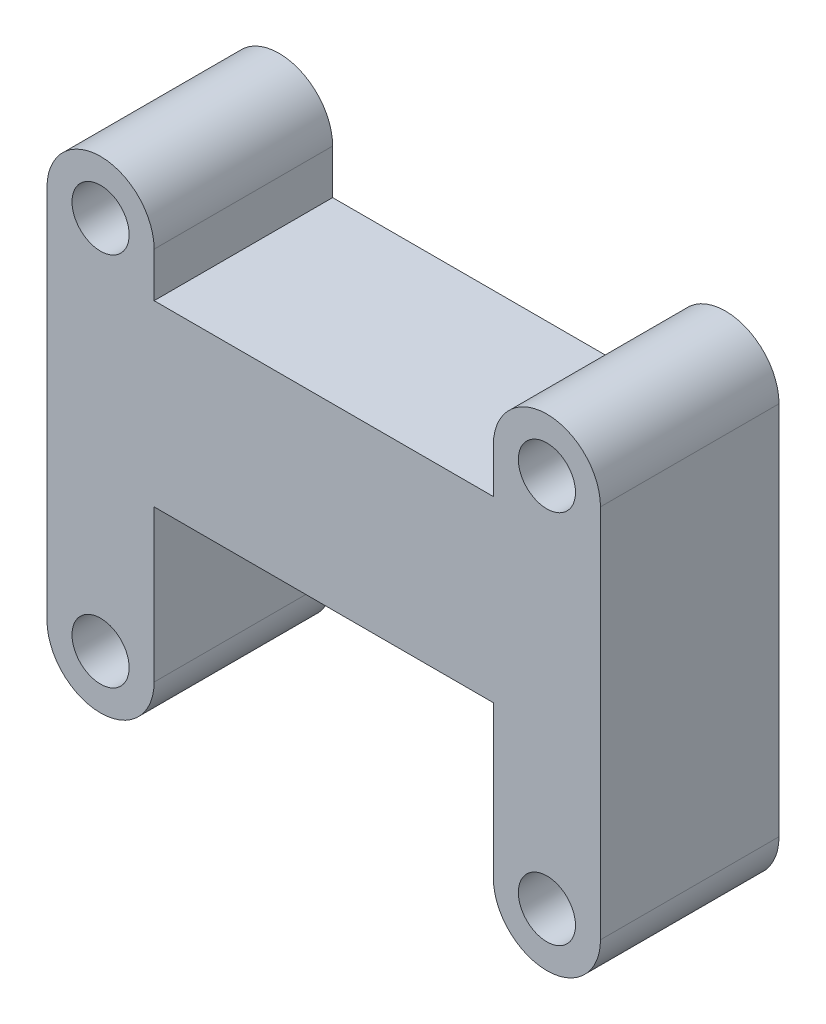
ISO-10303-21;
HEADER;
FILE_DESCRIPTION(('STEP AP214'),'2;1');
FILE_NAME('part.step','',(''),(''),'','','');
FILE_SCHEMA(('AUTOMOTIVE_DESIGN { 1 0 10303 214 1 1 1 1 }'));
ENDSEC;
DATA;
#1=APPLICATION_CONTEXT('core data for automotive mechanical design processes');
#2=APPLICATION_PROTOCOL_DEFINITION('international standard','automotive_design',2000,#1);
#3=PRODUCT_CONTEXT('',#1,'mechanical');
#4=PRODUCT('Part','Part','',(#3));
#5=PRODUCT_RELATED_PRODUCT_CATEGORY('part','',(#4));
#6=PRODUCT_DEFINITION_FORMATION('','',#4);
#7=PRODUCT_DEFINITION_CONTEXT('part definition',#1,'design');
#8=PRODUCT_DEFINITION('design','',#6,#7);
#9=PRODUCT_DEFINITION_SHAPE('','',#8);
#10=(LENGTH_UNIT() NAMED_UNIT(*) SI_UNIT(.MILLI.,.METRE.));
#11=(NAMED_UNIT(*) PLANE_ANGLE_UNIT() SI_UNIT($,.RADIAN.));
#12=(NAMED_UNIT(*) SI_UNIT($,.STERADIAN.) SOLID_ANGLE_UNIT());
#13=UNCERTAINTY_MEASURE_WITH_UNIT(LENGTH_MEASURE(1.E-05),#10,'distance_accuracy_value','');
#14=(GEOMETRIC_REPRESENTATION_CONTEXT(3) GLOBAL_UNCERTAINTY_ASSIGNED_CONTEXT((#13)) GLOBAL_UNIT_ASSIGNED_CONTEXT((#10,
#11,#12)) REPRESENTATION_CONTEXT('',''));
#15=CARTESIAN_POINT('',(0.,0.,0.));
#16=DIRECTION('',(0.,0.,1.));
#17=DIRECTION('',(1.,0.,0.));
#18=AXIS2_PLACEMENT_3D('',#15,#16,#17);
#19=CARTESIAN_POINT('',(3.,0.,10.));
#20=DIRECTION('',(-1.,0.,0.));
#21=DIRECTION('',(0.,0.,1.));
#22=AXIS2_PLACEMENT_3D('',#19,#20,#21);
#23=PLANE('',#22);
#24=DIRECTION('',(0.,1.,0.));
#25=VECTOR('',#24,1.);
#26=CARTESIAN_POINT('',(3.,0.,0.));
#27=LINE('',#26,#25);
#28=CARTESIAN_POINT('',(3.,0.,0.));
#29=VERTEX_POINT('',#28);
#30=CARTESIAN_POINT('',(3.,8.5,0.));
#31=VERTEX_POINT('',#30);
#32=EDGE_CURVE('E184',#29,#31,#27,.T.);
#33=ORIENTED_EDGE('',*,*,#32,.T.);
#34=DIRECTION('',(0.,0.,-1.));
#35=VECTOR('',#34,1.);
#36=CARTESIAN_POINT('',(3.,8.5,10.));
#37=LINE('',#36,#35);
#38=CARTESIAN_POINT('',(3.,8.5,10.));
#39=VERTEX_POINT('',#38);
#40=EDGE_CURVE('E11',#39,#31,#37,.T.);
#41=ORIENTED_EDGE('',*,*,#40,.F.);
#42=DIRECTION('',(0.,1.,0.));
#43=VECTOR('',#42,1.);
#44=CARTESIAN_POINT('',(3.,0.,10.));
#45=LINE('',#44,#43);
#46=CARTESIAN_POINT('',(3.,0.,10.));
#47=VERTEX_POINT('',#46);
#48=EDGE_CURVE('E281',#47,#39,#45,.T.);
#49=ORIENTED_EDGE('',*,*,#48,.F.);
#50=DIRECTION('',(0.,0.,-1.));
#51=VECTOR('',#50,1.);
#52=CARTESIAN_POINT('',(3.,0.,10.));
#53=LINE('',#52,#51);
#54=EDGE_CURVE('E175',#47,#29,#53,.T.);
#55=ORIENTED_EDGE('',*,*,#54,.T.);
#56=EDGE_LOOP('',(#33,#41,#49,#55));
#57=FACE_BOUND('',#56,.T.);
#58=ADVANCED_FACE('F41',(#57),#23,.F.);
#59=CARTESIAN_POINT('',(0.,8.5,10.));
#60=DIRECTION('',(0.,1.,0.));
#61=DIRECTION('',(0.,0.,1.));
#62=AXIS2_PLACEMENT_3D('',#59,#60,#61);
#63=PLANE('',#62);
#64=DIRECTION('',(1.,0.,0.));
#65=VECTOR('',#64,1.);
#66=CARTESIAN_POINT('',(0.,8.5,0.));
#67=LINE('',#66,#65);
#68=CARTESIAN_POINT('',(22.,8.5,0.));
#69=VERTEX_POINT('',#68);
#70=EDGE_CURVE('E188',#31,#69,#67,.T.);
#71=ORIENTED_EDGE('',*,*,#70,.T.);
#72=DIRECTION('',(0.,0.,-1.));
#73=VECTOR('',#72,1.);
#74=CARTESIAN_POINT('',(22.,8.5,10.));
#75=LINE('',#74,#73);
#76=CARTESIAN_POINT('',(22.,8.5,10.));
#77=VERTEX_POINT('',#76);
#78=EDGE_CURVE('E51',#77,#69,#75,.T.);
#79=ORIENTED_EDGE('',*,*,#78,.F.);
#80=DIRECTION('',(1.,0.,0.));
#81=VECTOR('',#80,1.);
#82=CARTESIAN_POINT('',(0.,8.5,10.));
#83=LINE('',#82,#81);
#84=EDGE_CURVE('E110',#39,#77,#83,.T.);
#85=ORIENTED_EDGE('',*,*,#84,.F.);
#86=ORIENTED_EDGE('',*,*,#40,.T.);
#87=EDGE_LOOP('',(#71,#79,#85,#86));
#88=FACE_BOUND('',#87,.T.);
#89=ADVANCED_FACE('F260',(#88),#63,.F.);
#90=CARTESIAN_POINT('',(22.,0.,10.));
#91=DIRECTION('',(-1.,0.,0.));
#92=DIRECTION('',(0.,-1.,0.));
#93=AXIS2_PLACEMENT_3D('',#90,#91,#92);
#94=PLANE('',#93);
#95=DIRECTION('',(0.,1.,0.));
#96=VECTOR('',#95,1.);
#97=CARTESIAN_POINT('',(22.,0.,0.));
#98=LINE('',#97,#96);
#99=CARTESIAN_POINT('',(22.,0.,0.));
#100=VERTEX_POINT('',#99);
#101=EDGE_CURVE('E193',#100,#69,#98,.T.);
#102=ORIENTED_EDGE('',*,*,#101,.F.);
#103=DIRECTION('',(0.,0.,-1.));
#104=VECTOR('',#103,1.);
#105=CARTESIAN_POINT('',(22.,0.,10.));
#106=LINE('',#105,#104);
#107=CARTESIAN_POINT('',(22.,0.,10.));
#108=VERTEX_POINT('',#107);
#109=EDGE_CURVE('E251',#108,#100,#106,.T.);
#110=ORIENTED_EDGE('',*,*,#109,.F.);
#111=DIRECTION('',(0.,1.,0.));
#112=VECTOR('',#111,1.);
#113=CARTESIAN_POINT('',(22.,0.,10.));
#114=LINE('',#113,#112);
#115=EDGE_CURVE('E259',#108,#77,#114,.T.);
#116=ORIENTED_EDGE('',*,*,#115,.T.);
#117=ORIENTED_EDGE('',*,*,#78,.T.);
#118=EDGE_LOOP('',(#102,#110,#116,#117));
#119=FACE_BOUND('',#118,.T.);
#120=ADVANCED_FACE('F257',(#119),#94,.T.);
#121=CARTESIAN_POINT('',(25.,0.,10.));
#122=DIRECTION('',(0.,0.,-1.));
#123=DIRECTION('',(-1.,0.,0.));
#124=AXIS2_PLACEMENT_3D('',#121,#122,#123);
#125=CYLINDRICAL_SURFACE('',#124,3.);
#126=CARTESIAN_POINT('',(25.,0.,0.));
#127=DIRECTION('',(0.,0.,1.));
#128=DIRECTION('',(1.,0.,0.));
#129=AXIS2_PLACEMENT_3D('',#126,#127,#128);
#130=CIRCLE('',#129,3.);
#131=CARTESIAN_POINT('',(28.,0.,0.));
#132=VERTEX_POINT('',#131);
#133=EDGE_CURVE('E197',#132,#100,#130,.F.);
#134=ORIENTED_EDGE('',*,*,#133,.F.);
#135=DIRECTION('',(0.,0.,-1.));
#136=VECTOR('',#135,1.);
#137=CARTESIAN_POINT('',(28.,0.,10.));
#138=LINE('',#137,#136);
#139=CARTESIAN_POINT('',(28.,0.,10.));
#140=VERTEX_POINT('',#139);
#141=EDGE_CURVE('E248',#140,#132,#138,.T.);
#142=ORIENTED_EDGE('',*,*,#141,.F.);
#143=CARTESIAN_POINT('',(25.,0.,10.));
#144=DIRECTION('',(0.,0.,1.));
#145=DIRECTION('',(1.,0.,0.));
#146=AXIS2_PLACEMENT_3D('',#143,#144,#145);
#147=CIRCLE('',#146,3.);
#148=EDGE_CURVE('E273',#140,#108,#147,.F.);
#149=ORIENTED_EDGE('',*,*,#148,.T.);
#150=ORIENTED_EDGE('',*,*,#109,.T.);
#151=EDGE_LOOP('',(#134,#142,#149,#150));
#152=FACE_BOUND('',#151,.T.);
#153=ADVANCED_FACE('F269',(#152),#125,.T.);
#154=CARTESIAN_POINT('',(28.,0.,10.));
#155=DIRECTION('',(-1.,0.,0.));
#156=DIRECTION('',(0.,-1.,0.));
#157=AXIS2_PLACEMENT_3D('',#154,#155,#156);
#158=PLANE('',#157);
#159=DIRECTION('',(0.,1.,0.));
#160=VECTOR('',#159,1.);
#161=CARTESIAN_POINT('',(28.,0.,0.));
#162=LINE('',#161,#160);
#163=CARTESIAN_POINT('',(28.,21.,0.));
#164=VERTEX_POINT('',#163);
#165=EDGE_CURVE('E202',#132,#164,#162,.T.);
#166=ORIENTED_EDGE('',*,*,#165,.T.);
#167=DIRECTION('',(0.,0.,-1.));
#168=VECTOR('',#167,1.);
#169=CARTESIAN_POINT('',(28.,21.,10.));
#170=LINE('',#169,#168);
#171=CARTESIAN_POINT('',(28.,21.,10.));
#172=VERTEX_POINT('',#171);
#173=EDGE_CURVE('E245',#172,#164,#170,.T.);
#174=ORIENTED_EDGE('',*,*,#173,.F.);
#175=DIRECTION('',(0.,1.,0.));
#176=VECTOR('',#175,1.);
#177=CARTESIAN_POINT('',(28.,0.,10.));
#178=LINE('',#177,#176);
#179=EDGE_CURVE('E279',#140,#172,#178,.T.);
#180=ORIENTED_EDGE('',*,*,#179,.F.);
#181=ORIENTED_EDGE('',*,*,#141,.T.);
#182=EDGE_LOOP('',(#166,#174,#180,#181));
#183=FACE_BOUND('',#182,.T.);
#184=ADVANCED_FACE('F300',(#183),#158,.F.);
#185=CARTESIAN_POINT('',(25.,21.,10.));
#186=DIRECTION('',(0.,0.,-1.));
#187=DIRECTION('',(-1.,0.,0.));
#188=AXIS2_PLACEMENT_3D('',#185,#186,#187);
#189=CYLINDRICAL_SURFACE('',#188,3.);
#190=CARTESIAN_POINT('',(25.,21.,0.));
#191=DIRECTION('',(0.,0.,1.));
#192=DIRECTION('',(1.,0.,0.));
#193=AXIS2_PLACEMENT_3D('',#190,#191,#192);
#194=CIRCLE('',#193,3.);
#195=CARTESIAN_POINT('',(22.,21.,0.));
#196=VERTEX_POINT('',#195);
#197=EDGE_CURVE('E206',#196,#164,#194,.F.);
#198=ORIENTED_EDGE('',*,*,#197,.F.);
#199=DIRECTION('',(0.,0.,-1.));
#200=VECTOR('',#199,1.);
#201=CARTESIAN_POINT('',(22.,21.,10.));
#202=LINE('',#201,#200);
#203=CARTESIAN_POINT('',(22.,21.,10.));
#204=VERTEX_POINT('',#203);
#205=EDGE_CURVE('E242',#204,#196,#202,.T.);
#206=ORIENTED_EDGE('',*,*,#205,.F.);
#207=CARTESIAN_POINT('',(25.,21.,10.));
#208=DIRECTION('',(0.,0.,1.));
#209=DIRECTION('',(1.,0.,0.));
#210=AXIS2_PLACEMENT_3D('',#207,#208,#209);
#211=CIRCLE('',#210,3.);
#212=EDGE_CURVE('E286',#204,#172,#211,.F.);
#213=ORIENTED_EDGE('',*,*,#212,.T.);
#214=ORIENTED_EDGE('',*,*,#173,.T.);
#215=EDGE_LOOP('',(#198,#206,#213,#214));
#216=FACE_BOUND('',#215,.T.);
#217=ADVANCED_FACE('F302',(#216),#189,.T.);
#218=CARTESIAN_POINT('',(22.,18.5,0.));
#219=VERTEX_POINT('',#218);
#220=EDGE_CURVE('E198',#219,#196,#98,.T.);
#221=ORIENTED_EDGE('',*,*,#220,.F.);
#222=DIRECTION('',(0.,0.,-1.));
#223=VECTOR('',#222,1.);
#224=CARTESIAN_POINT('',(22.,18.5,10.));
#225=LINE('',#224,#223);
#226=CARTESIAN_POINT('',(22.,18.5,10.));
#227=VERTEX_POINT('',#226);
#228=EDGE_CURVE('E239',#227,#219,#225,.T.);
#229=ORIENTED_EDGE('',*,*,#228,.F.);
#230=EDGE_CURVE('E276',#227,#204,#114,.T.);
#231=ORIENTED_EDGE('',*,*,#230,.T.);
#232=ORIENTED_EDGE('',*,*,#205,.T.);
#233=EDGE_LOOP('',(#221,#229,#231,#232));
#234=FACE_BOUND('',#233,.T.);
#235=ADVANCED_FACE('F324',(#234),#94,.T.);
#236=CARTESIAN_POINT('',(0.,18.5,10.));
#237=DIRECTION('',(0.,1.,0.));
#238=DIRECTION('',(0.,0.,1.));
#239=AXIS2_PLACEMENT_3D('',#236,#237,#238);
#240=PLANE('',#239);
#241=DIRECTION('',(1.,0.,0.));
#242=VECTOR('',#241,1.);
#243=CARTESIAN_POINT('',(0.,18.5,0.));
#244=LINE('',#243,#242);
#245=CARTESIAN_POINT('',(3.,18.5,0.));
#246=VERTEX_POINT('',#245);
#247=EDGE_CURVE('E210',#246,#219,#244,.T.);
#248=ORIENTED_EDGE('',*,*,#247,.F.);
#249=DIRECTION('',(0.,0.,-1.));
#250=VECTOR('',#249,1.);
#251=CARTESIAN_POINT('',(3.,18.5,10.));
#252=LINE('',#251,#250);
#253=CARTESIAN_POINT('',(3.,18.5,10.));
#254=VERTEX_POINT('',#253);
#255=EDGE_CURVE('E236',#254,#246,#252,.T.);
#256=ORIENTED_EDGE('',*,*,#255,.F.);
#257=DIRECTION('',(1.,0.,0.));
#258=VECTOR('',#257,1.);
#259=CARTESIAN_POINT('',(0.,18.5,10.));
#260=LINE('',#259,#258);
#261=EDGE_CURVE('E285',#254,#227,#260,.T.);
#262=ORIENTED_EDGE('',*,*,#261,.T.);
#263=ORIENTED_EDGE('',*,*,#228,.T.);
#264=EDGE_LOOP('',(#248,#256,#262,#263));
#265=FACE_BOUND('',#264,.T.);
#266=ADVANCED_FACE('F323',(#265),#240,.T.);
#267=CARTESIAN_POINT('',(3.,21.,0.));
#268=VERTEX_POINT('',#267);
#269=EDGE_CURVE('E189',#246,#268,#27,.T.);
#270=ORIENTED_EDGE('',*,*,#269,.T.);
#271=DIRECTION('',(0.,0.,-1.));
#272=VECTOR('',#271,1.);
#273=CARTESIAN_POINT('',(3.,21.,10.));
#274=LINE('',#273,#272);
#275=CARTESIAN_POINT('',(3.,21.,10.));
#276=VERTEX_POINT('',#275);
#277=EDGE_CURVE('E158',#276,#268,#274,.T.);
#278=ORIENTED_EDGE('',*,*,#277,.F.);
#279=EDGE_CURVE('E143',#254,#276,#45,.T.);
#280=ORIENTED_EDGE('',*,*,#279,.F.);
#281=ORIENTED_EDGE('',*,*,#255,.T.);
#282=EDGE_LOOP('',(#270,#278,#280,#281));
#283=FACE_BOUND('',#282,.T.);
#284=ADVANCED_FACE('F331',(#283),#23,.F.);
#285=CARTESIAN_POINT('',(0.,21.,10.));
#286=DIRECTION('',(0.,0.,-1.));
#287=DIRECTION('',(-1.,0.,0.));
#288=AXIS2_PLACEMENT_3D('',#285,#286,#287);
#289=CYLINDRICAL_SURFACE('',#288,3.);
#290=CARTESIAN_POINT('',(0.,21.,0.));
#291=DIRECTION('',(0.,0.,1.));
#292=DIRECTION('',(1.,0.,0.));
#293=AXIS2_PLACEMENT_3D('',#290,#291,#292);
#294=CIRCLE('',#293,3.);
#295=CARTESIAN_POINT('',(-3.,21.,0.));
#296=VERTEX_POINT('',#295);
#297=EDGE_CURVE('E153',#268,#296,#294,.T.);
#298=ORIENTED_EDGE('',*,*,#297,.T.);
#299=DIRECTION('',(0.,0.,-1.));
#300=VECTOR('',#299,1.);
#301=CARTESIAN_POINT('',(-3.,21.,10.));
#302=LINE('',#301,#300);
#303=CARTESIAN_POINT('',(-3.,21.,10.));
#304=VERTEX_POINT('',#303);
#305=EDGE_CURVE('E150',#304,#296,#302,.T.);
#306=ORIENTED_EDGE('',*,*,#305,.F.);
#307=CARTESIAN_POINT('',(0.,21.,10.));
#308=DIRECTION('',(0.,0.,1.));
#309=DIRECTION('',(1.,0.,0.));
#310=AXIS2_PLACEMENT_3D('',#307,#308,#309);
#311=CIRCLE('',#310,3.);
#312=EDGE_CURVE('E135',#276,#304,#311,.T.);
#313=ORIENTED_EDGE('',*,*,#312,.F.);
#314=ORIENTED_EDGE('',*,*,#277,.T.);
#315=EDGE_LOOP('',(#298,#306,#313,#314));
#316=FACE_BOUND('',#315,.T.);
#317=ADVANCED_FACE('F151',(#316),#289,.T.);
#318=CARTESIAN_POINT('',(-3.,0.,10.));
#319=DIRECTION('',(-1.,0.,0.));
#320=DIRECTION('',(0.,0.,1.));
#321=AXIS2_PLACEMENT_3D('',#318,#319,#320);
#322=PLANE('',#321);
#323=DIRECTION('',(0.,1.,0.));
#324=VECTOR('',#323,1.);
#325=CARTESIAN_POINT('',(-3.,0.,0.));
#326=LINE('',#325,#324);
#327=CARTESIAN_POINT('',(-3.,0.,0.));
#328=VERTEX_POINT('',#327);
#329=EDGE_CURVE('E216',#328,#296,#326,.T.);
#330=ORIENTED_EDGE('',*,*,#329,.F.);
#331=DIRECTION('',(0.,0.,-1.));
#332=VECTOR('',#331,1.);
#333=CARTESIAN_POINT('',(-3.,0.,10.));
#334=LINE('',#333,#332);
#335=CARTESIAN_POINT('',(-3.,0.,10.));
#336=VERTEX_POINT('',#335);
#337=EDGE_CURVE('E99',#336,#328,#334,.T.);
#338=ORIENTED_EDGE('',*,*,#337,.F.);
#339=DIRECTION('',(0.,1.,0.));
#340=VECTOR('',#339,1.);
#341=CARTESIAN_POINT('',(-3.,0.,10.));
#342=LINE('',#341,#340);
#343=EDGE_CURVE('E140',#336,#304,#342,.T.);
#344=ORIENTED_EDGE('',*,*,#343,.T.);
#345=ORIENTED_EDGE('',*,*,#305,.T.);
#346=EDGE_LOOP('',(#330,#338,#344,#345));
#347=FACE_BOUND('',#346,.T.);
#348=ADVANCED_FACE('F160',(#347),#322,.T.);
#349=CARTESIAN_POINT('',(25.,0.,10.));
#350=DIRECTION('',(0.,0.,-1.));
#351=DIRECTION('',(-1.,0.,0.));
#352=AXIS2_PLACEMENT_3D('',#349,#350,#351);
#353=CYLINDRICAL_SURFACE('',#352,1.6);
#354=CARTESIAN_POINT('',(25.,0.,10.));
#355=DIRECTION('',(0.,0.,1.));
#356=DIRECTION('',(1.,0.,0.));
#357=AXIS2_PLACEMENT_3D('',#354,#355,#356);
#358=CIRCLE('',#357,1.6);
#359=CARTESIAN_POINT('',(26.6,0.,10.));
#360=VERTEX_POINT('',#359);
#361=EDGE_CURVE('E164',#360,#360,#358,.F.);
#362=ORIENTED_EDGE('',*,*,#361,.F.);
#363=EDGE_LOOP('',(#362));
#364=FACE_BOUND('',#363,.T.);
#365=CARTESIAN_POINT('',(25.,0.,0.));
#366=DIRECTION('',(0.,0.,1.));
#367=DIRECTION('',(1.,0.,0.));
#368=AXIS2_PLACEMENT_3D('',#365,#366,#367);
#369=CIRCLE('',#368,1.6);
#370=CARTESIAN_POINT('',(26.6,0.,0.));
#371=VERTEX_POINT('',#370);
#372=EDGE_CURVE('E221',#371,#371,#369,.F.);
#373=ORIENTED_EDGE('',*,*,#372,.T.);
#374=EDGE_LOOP('',(#373));
#375=FACE_BOUND('',#374,.T.);
#376=ADVANCED_FACE('F349',(#364,#375),#353,.F.);
#377=CARTESIAN_POINT('',(0.,0.,10.));
#378=DIRECTION('',(0.,0.,-1.));
#379=DIRECTION('',(-1.,0.,0.));
#380=AXIS2_PLACEMENT_3D('',#377,#378,#379);
#381=CYLINDRICAL_SURFACE('',#380,3.);
#382=CARTESIAN_POINT('',(0.,0.,0.));
#383=DIRECTION('',(0.,0.,1.));
#384=DIRECTION('',(1.,0.,0.));
#385=AXIS2_PLACEMENT_3D('',#382,#383,#384);
#386=CIRCLE('',#385,3.);
#387=EDGE_CURVE('E102',#328,#29,#386,.T.);
#388=ORIENTED_EDGE('',*,*,#387,.T.);
#389=ORIENTED_EDGE('',*,*,#54,.F.);
#390=CARTESIAN_POINT('',(0.,0.,10.));
#391=DIRECTION('',(0.,0.,1.));
#392=DIRECTION('',(1.,0.,0.));
#393=AXIS2_PLACEMENT_3D('',#390,#391,#392);
#394=CIRCLE('',#393,3.);
#395=EDGE_CURVE('E59',#336,#47,#394,.T.);
#396=ORIENTED_EDGE('',*,*,#395,.F.);
#397=ORIENTED_EDGE('',*,*,#337,.T.);
#398=EDGE_LOOP('',(#388,#389,#396,#397));
#399=FACE_BOUND('',#398,.T.);
#400=ADVANCED_FACE('F352',(#399),#381,.T.);
#401=CARTESIAN_POINT('',(0.,21.,10.));
#402=DIRECTION('',(0.,0.,-1.));
#403=DIRECTION('',(-1.,0.,0.));
#404=AXIS2_PLACEMENT_3D('',#401,#402,#403);
#405=CYLINDRICAL_SURFACE('',#404,1.6);
#406=CARTESIAN_POINT('',(0.,21.,10.));
#407=DIRECTION('',(0.,0.,1.));
#408=DIRECTION('',(1.,0.,0.));
#409=AXIS2_PLACEMENT_3D('',#406,#407,#408);
#410=CIRCLE('',#409,1.6);
#411=CARTESIAN_POINT('',(1.6,21.,10.));
#412=VERTEX_POINT('',#411);
#413=EDGE_CURVE('E312',#412,#412,#410,.T.);
#414=ORIENTED_EDGE('',*,*,#413,.T.);
#415=EDGE_LOOP('',(#414));
#416=FACE_BOUND('',#415,.T.);
#417=CARTESIAN_POINT('',(0.,21.,0.));
#418=DIRECTION('',(0.,0.,1.));
#419=DIRECTION('',(1.,0.,0.));
#420=AXIS2_PLACEMENT_3D('',#417,#418,#419);
#421=CIRCLE('',#420,1.6);
#422=CARTESIAN_POINT('',(1.6,21.,0.));
#423=VERTEX_POINT('',#422);
#424=EDGE_CURVE('E180',#423,#423,#421,.T.);
#425=ORIENTED_EDGE('',*,*,#424,.F.);
#426=EDGE_LOOP('',(#425));
#427=FACE_BOUND('',#426,.T.);
#428=ADVANCED_FACE('F355',(#416,#427),#405,.F.);
#429=CARTESIAN_POINT('',(0.,0.,10.));
#430=DIRECTION('',(0.,0.,-1.));
#431=DIRECTION('',(-1.,0.,0.));
#432=AXIS2_PLACEMENT_3D('',#429,#430,#431);
#433=CYLINDRICAL_SURFACE('',#432,1.6);
#434=CARTESIAN_POINT('',(0.,0.,10.));
#435=DIRECTION('',(0.,0.,1.));
#436=DIRECTION('',(1.,0.,0.));
#437=AXIS2_PLACEMENT_3D('',#434,#435,#436);
#438=CIRCLE('',#437,1.6);
#439=CARTESIAN_POINT('',(1.6,0.,10.));
#440=VERTEX_POINT('',#439);
#441=EDGE_CURVE('E229',#440,#440,#438,.T.);
#442=ORIENTED_EDGE('',*,*,#441,.T.);
#443=EDGE_LOOP('',(#442));
#444=FACE_BOUND('',#443,.T.);
#445=CARTESIAN_POINT('',(0.,0.,0.));
#446=DIRECTION('',(0.,0.,1.));
#447=DIRECTION('',(1.,0.,0.));
#448=AXIS2_PLACEMENT_3D('',#445,#446,#447);
#449=CIRCLE('',#448,1.6);
#450=CARTESIAN_POINT('',(1.6,0.,0.));
#451=VERTEX_POINT('',#450);
#452=EDGE_CURVE('E176',#451,#451,#449,.T.);
#453=ORIENTED_EDGE('',*,*,#452,.F.);
#454=EDGE_LOOP('',(#453));
#455=FACE_BOUND('',#454,.T.);
#456=ADVANCED_FACE('F43',(#444,#455),#433,.F.);
#457=CARTESIAN_POINT('',(25.,21.,10.));
#458=DIRECTION('',(0.,0.,-1.));
#459=DIRECTION('',(-1.,0.,0.));
#460=AXIS2_PLACEMENT_3D('',#457,#458,#459);
#461=CYLINDRICAL_SURFACE('',#460,1.6);
#462=CARTESIAN_POINT('',(25.,21.,10.));
#463=DIRECTION('',(0.,0.,1.));
#464=DIRECTION('',(1.,0.,0.));
#465=AXIS2_PLACEMENT_3D('',#462,#463,#464);
#466=CIRCLE('',#465,1.6);
#467=CARTESIAN_POINT('',(26.6,21.,10.));
#468=VERTEX_POINT('',#467);
#469=EDGE_CURVE('E171',#468,#468,#466,.F.);
#470=ORIENTED_EDGE('',*,*,#469,.F.);
#471=EDGE_LOOP('',(#470));
#472=FACE_BOUND('',#471,.T.);
#473=CARTESIAN_POINT('',(25.,21.,0.));
#474=DIRECTION('',(0.,0.,1.));
#475=DIRECTION('',(1.,0.,0.));
#476=AXIS2_PLACEMENT_3D('',#473,#474,#475);
#477=CIRCLE('',#476,1.6);
#478=CARTESIAN_POINT('',(26.6,21.,0.));
#479=VERTEX_POINT('',#478);
#480=EDGE_CURVE('E225',#479,#479,#477,.F.);
#481=ORIENTED_EDGE('',*,*,#480,.T.);
#482=EDGE_LOOP('',(#481));
#483=FACE_BOUND('',#482,.T.);
#484=ADVANCED_FACE('F359',(#472,#483),#461,.F.);
#485=CARTESIAN_POINT('',(0.,0.,10.));
#486=DIRECTION('',(0.,0.,1.));
#487=DIRECTION('',(1.,0.,0.));
#488=AXIS2_PLACEMENT_3D('',#485,#486,#487);
#489=PLANE('',#488);
#490=ORIENTED_EDGE('',*,*,#441,.F.);
#491=EDGE_LOOP('',(#490));
#492=FACE_BOUND('',#491,.T.);
#493=ORIENTED_EDGE('',*,*,#413,.F.);
#494=EDGE_LOOP('',(#493));
#495=FACE_BOUND('',#494,.T.);
#496=ORIENTED_EDGE('',*,*,#48,.T.);
#497=ORIENTED_EDGE('',*,*,#84,.T.);
#498=ORIENTED_EDGE('',*,*,#115,.F.);
#499=ORIENTED_EDGE('',*,*,#148,.F.);
#500=ORIENTED_EDGE('',*,*,#179,.T.);
#501=ORIENTED_EDGE('',*,*,#212,.F.);
#502=ORIENTED_EDGE('',*,*,#230,.F.);
#503=ORIENTED_EDGE('',*,*,#261,.F.);
#504=ORIENTED_EDGE('',*,*,#279,.T.);
#505=ORIENTED_EDGE('',*,*,#312,.T.);
#506=ORIENTED_EDGE('',*,*,#343,.F.);
#507=ORIENTED_EDGE('',*,*,#395,.T.);
#508=EDGE_LOOP('',(#496,#497,#498,#499,#500,#501,#502,#503,#504,#505,#506,#507));
#509=FACE_BOUND('',#508,.T.);
#510=ORIENTED_EDGE('',*,*,#361,.T.);
#511=EDGE_LOOP('',(#510));
#512=FACE_BOUND('',#511,.T.);
#513=ORIENTED_EDGE('',*,*,#469,.T.);
#514=EDGE_LOOP('',(#513));
#515=FACE_BOUND('',#514,.T.);
#516=ADVANCED_FACE('F137',(#492,#495,#509,#512,#515),#489,.T.);
#517=CARTESIAN_POINT('',(0.,0.,0.));
#518=DIRECTION('',(0.,0.,1.));
#519=DIRECTION('',(1.,0.,0.));
#520=AXIS2_PLACEMENT_3D('',#517,#518,#519);
#521=PLANE('',#520);
#522=ORIENTED_EDGE('',*,*,#452,.T.);
#523=EDGE_LOOP('',(#522));
#524=FACE_BOUND('',#523,.T.);
#525=ORIENTED_EDGE('',*,*,#424,.T.);
#526=EDGE_LOOP('',(#525));
#527=FACE_BOUND('',#526,.T.);
#528=ORIENTED_EDGE('',*,*,#32,.F.);
#529=ORIENTED_EDGE('',*,*,#387,.F.);
#530=ORIENTED_EDGE('',*,*,#329,.T.);
#531=ORIENTED_EDGE('',*,*,#297,.F.);
#532=ORIENTED_EDGE('',*,*,#269,.F.);
#533=ORIENTED_EDGE('',*,*,#247,.T.);
#534=ORIENTED_EDGE('',*,*,#220,.T.);
#535=ORIENTED_EDGE('',*,*,#197,.T.);
#536=ORIENTED_EDGE('',*,*,#165,.F.);
#537=ORIENTED_EDGE('',*,*,#133,.T.);
#538=ORIENTED_EDGE('',*,*,#101,.T.);
#539=ORIENTED_EDGE('',*,*,#70,.F.);
#540=EDGE_LOOP('',(#528,#529,#530,#531,#532,#533,#534,#535,#536,#537,#538,#539));
#541=FACE_BOUND('',#540,.T.);
#542=ORIENTED_EDGE('',*,*,#372,.F.);
#543=EDGE_LOOP('',(#542));
#544=FACE_BOUND('',#543,.T.);
#545=ORIENTED_EDGE('',*,*,#480,.F.);
#546=EDGE_LOOP('',(#545));
#547=FACE_BOUND('',#546,.T.);
#548=ADVANCED_FACE('F264',(#524,#527,#541,#544,#547),#521,.F.);
#549=CLOSED_SHELL('',(#58,#89,#120,#153,#184,#217,#235,#266,#284,#317,#348,#376,#400,#428,#456,
#484,#516,#548));
#550=MANIFOLD_SOLID_BREP('B2',#549);
#551=ADVANCED_BREP_SHAPE_REPRESENTATION('',(#18,#550),#14);
#552=SHAPE_DEFINITION_REPRESENTATION(#9,#551);
ENDSEC;
END-ISO-10303-21;
